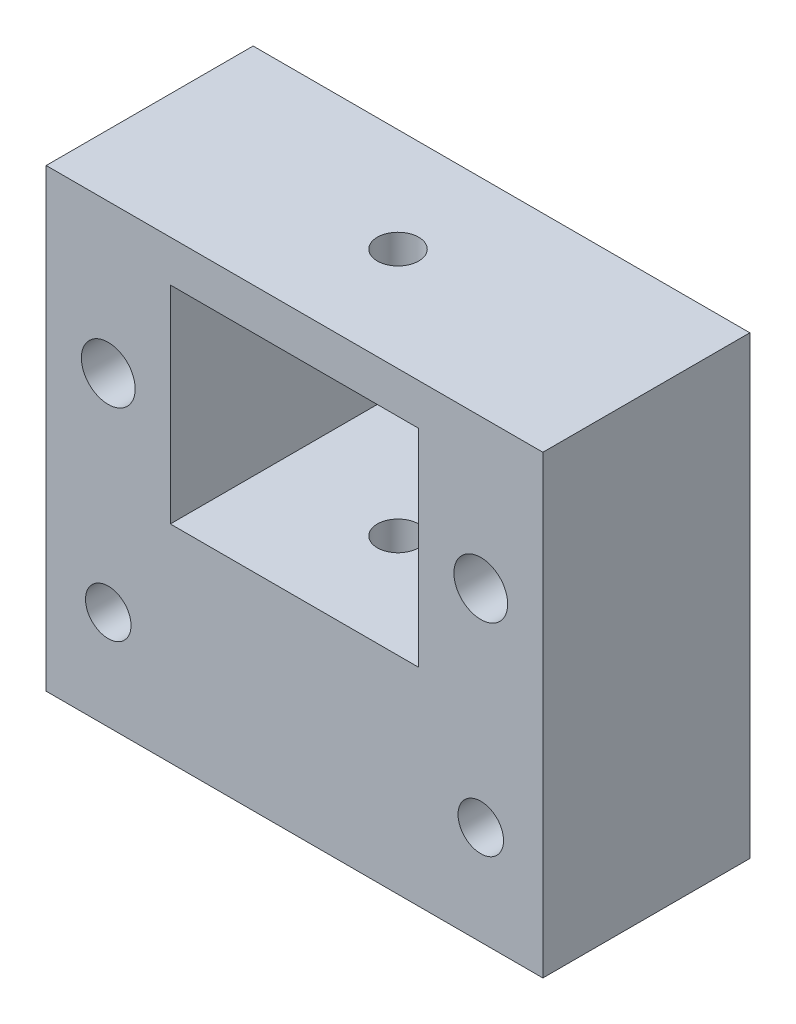
ISO-10303-21;
HEADER;
FILE_DESCRIPTION(('STEP AP214'),'2;1');
FILE_NAME('part.step','',(''),(''),'','','');
FILE_SCHEMA(('AUTOMOTIVE_DESIGN { 1 0 10303 214 1 1 1 1 }'));
ENDSEC;
DATA;
#1=APPLICATION_CONTEXT('core data for automotive mechanical design processes');
#2=APPLICATION_PROTOCOL_DEFINITION('international standard','automotive_design',2000,#1);
#3=PRODUCT_CONTEXT('',#1,'mechanical');
#4=PRODUCT('Part','Part','',(#3));
#5=PRODUCT_RELATED_PRODUCT_CATEGORY('part','',(#4));
#6=PRODUCT_DEFINITION_FORMATION('','',#4);
#7=PRODUCT_DEFINITION_CONTEXT('part definition',#1,'design');
#8=PRODUCT_DEFINITION('design','',#6,#7);
#9=PRODUCT_DEFINITION_SHAPE('','',#8);
#10=(LENGTH_UNIT() NAMED_UNIT(*) SI_UNIT(.MILLI.,.METRE.));
#11=(NAMED_UNIT(*) PLANE_ANGLE_UNIT() SI_UNIT($,.RADIAN.));
#12=(NAMED_UNIT(*) SI_UNIT($,.STERADIAN.) SOLID_ANGLE_UNIT());
#13=UNCERTAINTY_MEASURE_WITH_UNIT(LENGTH_MEASURE(1.E-05),#10,'distance_accuracy_value','');
#14=(GEOMETRIC_REPRESENTATION_CONTEXT(3) GLOBAL_UNCERTAINTY_ASSIGNED_CONTEXT((#13)) GLOBAL_UNIT_ASSIGNED_CONTEXT((#10,
#11,#12)) REPRESENTATION_CONTEXT('',''));
#15=CARTESIAN_POINT('',(0.,0.,0.));
#16=DIRECTION('',(0.,0.,1.));
#17=DIRECTION('',(1.,0.,0.));
#18=AXIS2_PLACEMENT_3D('',#15,#16,#17);
#19=CARTESIAN_POINT('',(7.5,37.,-25.));
#20=DIRECTION('',(0.,0.,1.));
#21=DIRECTION('',(1.,0.,0.));
#22=AXIS2_PLACEMENT_3D('',#19,#20,#21);
#23=CYLINDRICAL_SURFACE('',#22,3.25);
#24=CARTESIAN_POINT('',(7.5,37.,0.));
#25=DIRECTION('',(0.,0.,1.));
#26=DIRECTION('',(1.,0.,0.));
#27=AXIS2_PLACEMENT_3D('',#24,#25,#26);
#28=CIRCLE('',#27,3.25);
#29=CARTESIAN_POINT('',(10.75,37.,0.));
#30=VERTEX_POINT('',#29);
#31=EDGE_CURVE('E194',#30,#30,#28,.T.);
#32=ORIENTED_EDGE('',*,*,#31,.T.);
#33=EDGE_LOOP('',(#32));
#34=FACE_BOUND('',#33,.T.);
#35=CARTESIAN_POINT('',(7.5,37.,-13.5));
#36=DIRECTION('',(0.,0.,-1.));
#37=DIRECTION('',(-1.,0.,0.));
#38=AXIS2_PLACEMENT_3D('',#35,#36,#37);
#39=CIRCLE('',#38,3.25);
#40=CARTESIAN_POINT('',(4.25,37.,-13.5));
#41=VERTEX_POINT('',#40);
#42=EDGE_CURVE('E36',#41,#41,#39,.F.);
#43=ORIENTED_EDGE('',*,*,#42,.F.);
#44=EDGE_LOOP('',(#43));
#45=FACE_BOUND('',#44,.T.);
#46=ADVANCED_FACE('F32',(#34,#45),#23,.F.);
#47=CARTESIAN_POINT('',(52.5,37.,-25.));
#48=DIRECTION('',(0.,0.,1.));
#49=DIRECTION('',(1.,0.,0.));
#50=AXIS2_PLACEMENT_3D('',#47,#48,#49);
#51=CYLINDRICAL_SURFACE('',#50,3.25);
#52=CARTESIAN_POINT('',(52.5,37.,0.));
#53=DIRECTION('',(0.,0.,1.));
#54=DIRECTION('',(1.,0.,0.));
#55=AXIS2_PLACEMENT_3D('',#52,#53,#54);
#56=CIRCLE('',#55,3.25);
#57=CARTESIAN_POINT('',(55.75,37.,0.));
#58=VERTEX_POINT('',#57);
#59=EDGE_CURVE('E167',#58,#58,#56,.T.);
#60=ORIENTED_EDGE('',*,*,#59,.T.);
#61=EDGE_LOOP('',(#60));
#62=FACE_BOUND('',#61,.T.);
#63=CARTESIAN_POINT('',(52.5,37.,-13.5));
#64=DIRECTION('',(0.,0.,-1.));
#65=DIRECTION('',(-1.,0.,0.));
#66=AXIS2_PLACEMENT_3D('',#63,#64,#65);
#67=CIRCLE('',#66,3.25);
#68=CARTESIAN_POINT('',(49.25,37.,-13.5));
#69=VERTEX_POINT('',#68);
#70=EDGE_CURVE('E165',#69,#69,#67,.F.);
#71=ORIENTED_EDGE('',*,*,#70,.F.);
#72=EDGE_LOOP('',(#71));
#73=FACE_BOUND('',#72,.T.);
#74=ADVANCED_FACE('F225',(#62,#73),#51,.F.);
#75=CARTESIAN_POINT('',(0.,55.,0.));
#76=DIRECTION('',(0.,0.,-1.));
#77=DIRECTION('',(-1.,0.,0.));
#78=AXIS2_PLACEMENT_3D('',#75,#76,#77);
#79=PLANE('',#78);
#80=ORIENTED_EDGE('',*,*,#59,.F.);
#81=EDGE_LOOP('',(#80));
#82=FACE_BOUND('',#81,.T.);
#83=CARTESIAN_POINT('',(52.5,12.,0.));
#84=DIRECTION('',(0.,0.,1.));
#85=DIRECTION('',(1.,0.,0.));
#86=AXIS2_PLACEMENT_3D('',#83,#84,#85);
#87=CIRCLE('',#86,2.75);
#88=CARTESIAN_POINT('',(55.25,12.,0.));
#89=VERTEX_POINT('',#88);
#90=EDGE_CURVE('E172',#89,#89,#87,.T.);
#91=ORIENTED_EDGE('',*,*,#90,.F.);
#92=EDGE_LOOP('',(#91));
#93=FACE_BOUND('',#92,.T.);
#94=CARTESIAN_POINT('',(7.5,12.,0.));
#95=DIRECTION('',(0.,0.,1.));
#96=DIRECTION('',(1.,0.,0.));
#97=AXIS2_PLACEMENT_3D('',#94,#95,#96);
#98=CIRCLE('',#97,2.75);
#99=CARTESIAN_POINT('',(10.25,12.,0.));
#100=VERTEX_POINT('',#99);
#101=EDGE_CURVE('E188',#100,#100,#98,.T.);
#102=ORIENTED_EDGE('',*,*,#101,.F.);
#103=EDGE_LOOP('',(#102));
#104=FACE_BOUND('',#103,.T.);
#105=ORIENTED_EDGE('',*,*,#31,.F.);
#106=EDGE_LOOP('',(#105));
#107=FACE_BOUND('',#106,.T.);
#108=DIRECTION('',(0.,-1.,0.));
#109=VECTOR('',#108,1.);
#110=CARTESIAN_POINT('',(15.,50.,0.));
#111=LINE('',#110,#109);
#112=CARTESIAN_POINT('',(15.,50.,0.));
#113=VERTEX_POINT('',#112);
#114=CARTESIAN_POINT('',(15.,25.,0.));
#115=VERTEX_POINT('',#114);
#116=EDGE_CURVE('E121',#113,#115,#111,.T.);
#117=ORIENTED_EDGE('',*,*,#116,.F.);
#118=DIRECTION('',(-1.,0.,0.));
#119=VECTOR('',#118,1.);
#120=CARTESIAN_POINT('',(15.,50.,0.));
#121=LINE('',#120,#119);
#122=CARTESIAN_POINT('',(45.,50.,0.));
#123=VERTEX_POINT('',#122);
#124=EDGE_CURVE('E49',#123,#113,#121,.T.);
#125=ORIENTED_EDGE('',*,*,#124,.F.);
#126=DIRECTION('',(0.,1.,0.));
#127=VECTOR('',#126,1.);
#128=CARTESIAN_POINT('',(45.,50.,0.));
#129=LINE('',#128,#127);
#130=CARTESIAN_POINT('',(45.,25.,0.));
#131=VERTEX_POINT('',#130);
#132=EDGE_CURVE('E107',#131,#123,#129,.T.);
#133=ORIENTED_EDGE('',*,*,#132,.F.);
#134=DIRECTION('',(1.,0.,0.));
#135=VECTOR('',#134,1.);
#136=CARTESIAN_POINT('',(15.,25.,0.));
#137=LINE('',#136,#135);
#138=EDGE_CURVE('E127',#115,#131,#137,.T.);
#139=ORIENTED_EDGE('',*,*,#138,.F.);
#140=EDGE_LOOP('',(#117,#125,#133,#139));
#141=FACE_BOUND('',#140,.T.);
#142=DIRECTION('',(1.,0.,0.));
#143=VECTOR('',#142,1.);
#144=CARTESIAN_POINT('',(0.,0.,0.));
#145=LINE('',#144,#143);
#146=CARTESIAN_POINT('',(0.,0.,0.));
#147=VERTEX_POINT('',#146);
#148=CARTESIAN_POINT('',(60.,0.,0.));
#149=VERTEX_POINT('',#148);
#150=EDGE_CURVE('E113',#147,#149,#145,.T.);
#151=ORIENTED_EDGE('',*,*,#150,.T.);
#152=DIRECTION('',(0.,-1.,0.));
#153=VECTOR('',#152,1.);
#154=CARTESIAN_POINT('',(60.,55.,0.));
#155=LINE('',#154,#153);
#156=CARTESIAN_POINT('',(60.,55.,0.));
#157=VERTEX_POINT('',#156);
#158=EDGE_CURVE('E11',#157,#149,#155,.T.);
#159=ORIENTED_EDGE('',*,*,#158,.F.);
#160=DIRECTION('',(1.,0.,0.));
#161=VECTOR('',#160,1.);
#162=CARTESIAN_POINT('',(0.,55.,0.));
#163=LINE('',#162,#161);
#164=CARTESIAN_POINT('',(0.,55.,0.));
#165=VERTEX_POINT('',#164);
#166=EDGE_CURVE('E136',#165,#157,#163,.T.);
#167=ORIENTED_EDGE('',*,*,#166,.F.);
#168=DIRECTION('',(0.,-1.,0.));
#169=VECTOR('',#168,1.);
#170=CARTESIAN_POINT('',(0.,55.,0.));
#171=LINE('',#170,#169);
#172=EDGE_CURVE('E146',#165,#147,#171,.T.);
#173=ORIENTED_EDGE('',*,*,#172,.T.);
#174=EDGE_LOOP('',(#151,#159,#167,#173));
#175=FACE_BOUND('',#174,.T.);
#176=ADVANCED_FACE('F34',(#82,#93,#104,#107,#141,#175),#79,.F.);
#177=CARTESIAN_POINT('',(60.,55.,0.));
#178=DIRECTION('',(-1.,0.,0.));
#179=DIRECTION('',(0.,0.,1.));
#180=AXIS2_PLACEMENT_3D('',#177,#178,#179);
#181=PLANE('',#180);
#182=DIRECTION('',(0.,0.,-1.));
#183=VECTOR('',#182,1.);
#184=CARTESIAN_POINT('',(60.,0.,0.));
#185=LINE('',#184,#183);
#186=CARTESIAN_POINT('',(60.,0.,-25.));
#187=VERTEX_POINT('',#186);
#188=EDGE_CURVE('E149',#149,#187,#185,.T.);
#189=ORIENTED_EDGE('',*,*,#188,.T.);
#190=DIRECTION('',(0.,-1.,0.));
#191=VECTOR('',#190,1.);
#192=CARTESIAN_POINT('',(60.,55.,-25.));
#193=LINE('',#192,#191);
#194=CARTESIAN_POINT('',(60.,55.,-25.));
#195=VERTEX_POINT('',#194);
#196=EDGE_CURVE('E41',#195,#187,#193,.T.);
#197=ORIENTED_EDGE('',*,*,#196,.F.);
#198=DIRECTION('',(0.,0.,-1.));
#199=VECTOR('',#198,1.);
#200=CARTESIAN_POINT('',(60.,55.,0.));
#201=LINE('',#200,#199);
#202=EDGE_CURVE('E139',#157,#195,#201,.T.);
#203=ORIENTED_EDGE('',*,*,#202,.F.);
#204=ORIENTED_EDGE('',*,*,#158,.T.);
#205=EDGE_LOOP('',(#189,#197,#203,#204));
#206=FACE_BOUND('',#205,.T.);
#207=ADVANCED_FACE('F266',(#206),#181,.F.);
#208=CARTESIAN_POINT('',(0.,55.,-25.));
#209=DIRECTION('',(0.,0.,1.));
#210=DIRECTION('',(1.,0.,0.));
#211=AXIS2_PLACEMENT_3D('',#208,#209,#210);
#212=PLANE('',#211);
#213=CARTESIAN_POINT('',(7.5,37.,-25.));
#214=DIRECTION('',(0.,0.,-1.));
#215=DIRECTION('',(-1.,0.,0.));
#216=AXIS2_PLACEMENT_3D('',#213,#214,#215);
#217=CIRCLE('',#216,4.45);
#218=CARTESIAN_POINT('',(3.05,37.,-25.));
#219=VERTEX_POINT('',#218);
#220=EDGE_CURVE('E182',#219,#219,#217,.T.);
#221=ORIENTED_EDGE('',*,*,#220,.F.);
#222=EDGE_LOOP('',(#221));
#223=FACE_BOUND('',#222,.T.);
#224=CARTESIAN_POINT('',(52.5,37.,-25.));
#225=DIRECTION('',(0.,0.,-1.));
#226=DIRECTION('',(-1.,0.,0.));
#227=AXIS2_PLACEMENT_3D('',#224,#225,#226);
#228=CIRCLE('',#227,4.45);
#229=CARTESIAN_POINT('',(48.05,37.,-25.));
#230=VERTEX_POINT('',#229);
#231=EDGE_CURVE('E175',#230,#230,#228,.T.);
#232=ORIENTED_EDGE('',*,*,#231,.F.);
#233=EDGE_LOOP('',(#232));
#234=FACE_BOUND('',#233,.T.);
#235=CARTESIAN_POINT('',(52.5,12.,-25.));
#236=DIRECTION('',(0.,0.,1.));
#237=DIRECTION('',(1.,0.,0.));
#238=AXIS2_PLACEMENT_3D('',#235,#236,#237);
#239=CIRCLE('',#238,2.75);
#240=CARTESIAN_POINT('',(55.25,12.,-25.));
#241=VERTEX_POINT('',#240);
#242=EDGE_CURVE('E185',#241,#241,#239,.T.);
#243=ORIENTED_EDGE('',*,*,#242,.T.);
#244=EDGE_LOOP('',(#243));
#245=FACE_BOUND('',#244,.T.);
#246=CARTESIAN_POINT('',(7.5,12.,-25.));
#247=DIRECTION('',(0.,0.,1.));
#248=DIRECTION('',(1.,0.,0.));
#249=AXIS2_PLACEMENT_3D('',#246,#247,#248);
#250=CIRCLE('',#249,2.75);
#251=CARTESIAN_POINT('',(10.25,12.,-25.));
#252=VERTEX_POINT('',#251);
#253=EDGE_CURVE('E191',#252,#252,#250,.T.);
#254=ORIENTED_EDGE('',*,*,#253,.T.);
#255=EDGE_LOOP('',(#254));
#256=FACE_BOUND('',#255,.T.);
#257=DIRECTION('',(0.,-1.,0.));
#258=VECTOR('',#257,1.);
#259=CARTESIAN_POINT('',(45.,50.,-25.));
#260=LINE('',#259,#258);
#261=CARTESIAN_POINT('',(45.,50.,-25.));
#262=VERTEX_POINT('',#261);
#263=CARTESIAN_POINT('',(45.,25.,-25.));
#264=VERTEX_POINT('',#263);
#265=EDGE_CURVE('E119',#262,#264,#260,.T.);
#266=ORIENTED_EDGE('',*,*,#265,.F.);
#267=DIRECTION('',(1.,0.,0.));
#268=VECTOR('',#267,1.);
#269=CARTESIAN_POINT('',(15.,50.,-25.));
#270=LINE('',#269,#268);
#271=CARTESIAN_POINT('',(15.,50.,-25.));
#272=VERTEX_POINT('',#271);
#273=EDGE_CURVE('E101',#272,#262,#270,.T.);
#274=ORIENTED_EDGE('',*,*,#273,.F.);
#275=DIRECTION('',(0.,1.,0.));
#276=VECTOR('',#275,1.);
#277=CARTESIAN_POINT('',(15.,50.,-25.));
#278=LINE('',#277,#276);
#279=CARTESIAN_POINT('',(15.,25.,-25.));
#280=VERTEX_POINT('',#279);
#281=EDGE_CURVE('E110',#280,#272,#278,.T.);
#282=ORIENTED_EDGE('',*,*,#281,.F.);
#283=DIRECTION('',(-1.,0.,0.));
#284=VECTOR('',#283,1.);
#285=CARTESIAN_POINT('',(15.,25.,-25.));
#286=LINE('',#285,#284);
#287=EDGE_CURVE('E57',#264,#280,#286,.T.);
#288=ORIENTED_EDGE('',*,*,#287,.F.);
#289=EDGE_LOOP('',(#266,#274,#282,#288));
#290=FACE_BOUND('',#289,.T.);
#291=DIRECTION('',(-1.,0.,0.));
#292=VECTOR('',#291,1.);
#293=CARTESIAN_POINT('',(0.,0.,-25.));
#294=LINE('',#293,#292);
#295=CARTESIAN_POINT('',(0.,0.,-25.));
#296=VERTEX_POINT('',#295);
#297=EDGE_CURVE('E151',#187,#296,#294,.T.);
#298=ORIENTED_EDGE('',*,*,#297,.T.);
#299=DIRECTION('',(0.,-1.,0.));
#300=VECTOR('',#299,1.);
#301=CARTESIAN_POINT('',(0.,55.,-25.));
#302=LINE('',#301,#300);
#303=CARTESIAN_POINT('',(0.,55.,-25.));
#304=VERTEX_POINT('',#303);
#305=EDGE_CURVE('E156',#304,#296,#302,.T.);
#306=ORIENTED_EDGE('',*,*,#305,.F.);
#307=DIRECTION('',(-1.,0.,0.));
#308=VECTOR('',#307,1.);
#309=CARTESIAN_POINT('',(0.,55.,-25.));
#310=LINE('',#309,#308);
#311=EDGE_CURVE('E142',#195,#304,#310,.T.);
#312=ORIENTED_EDGE('',*,*,#311,.F.);
#313=ORIENTED_EDGE('',*,*,#196,.T.);
#314=EDGE_LOOP('',(#298,#306,#312,#313));
#315=FACE_BOUND('',#314,.T.);
#316=ADVANCED_FACE('F116',(#223,#234,#245,#256,#290,#315),#212,.F.);
#317=CARTESIAN_POINT('',(0.,55.,0.));
#318=DIRECTION('',(1.,0.,0.));
#319=DIRECTION('',(0.,0.,-1.));
#320=AXIS2_PLACEMENT_3D('',#317,#318,#319);
#321=PLANE('',#320);
#322=DIRECTION('',(0.,0.,1.));
#323=VECTOR('',#322,1.);
#324=CARTESIAN_POINT('',(0.,0.,0.));
#325=LINE('',#324,#323);
#326=EDGE_CURVE('E140',#296,#147,#325,.T.);
#327=ORIENTED_EDGE('',*,*,#326,.T.);
#328=ORIENTED_EDGE('',*,*,#172,.F.);
#329=DIRECTION('',(0.,0.,1.));
#330=VECTOR('',#329,1.);
#331=CARTESIAN_POINT('',(0.,55.,0.));
#332=LINE('',#331,#330);
#333=EDGE_CURVE('E144',#304,#165,#332,.T.);
#334=ORIENTED_EDGE('',*,*,#333,.F.);
#335=ORIENTED_EDGE('',*,*,#305,.T.);
#336=EDGE_LOOP('',(#327,#328,#334,#335));
#337=FACE_BOUND('',#336,.T.);
#338=ADVANCED_FACE('F265',(#337),#321,.F.);
#339=CARTESIAN_POINT('',(0.,55.,0.));
#340=DIRECTION('',(0.,1.,0.));
#341=DIRECTION('',(0.,0.,1.));
#342=AXIS2_PLACEMENT_3D('',#339,#340,#341);
#343=PLANE('',#342);
#344=CARTESIAN_POINT('',(30.,55.,-12.5));
#345=DIRECTION('',(0.,1.,0.));
#346=DIRECTION('',(0.,0.,1.));
#347=AXIS2_PLACEMENT_3D('',#344,#345,#346);
#348=CIRCLE('',#347,2.5);
#349=CARTESIAN_POINT('',(30.,55.,-10.));
#350=VERTEX_POINT('',#349);
#351=EDGE_CURVE('E199',#350,#350,#348,.T.);
#352=ORIENTED_EDGE('',*,*,#351,.F.);
#353=EDGE_LOOP('',(#352));
#354=FACE_BOUND('',#353,.T.);
#355=ORIENTED_EDGE('',*,*,#166,.T.);
#356=ORIENTED_EDGE('',*,*,#202,.T.);
#357=ORIENTED_EDGE('',*,*,#311,.T.);
#358=ORIENTED_EDGE('',*,*,#333,.T.);
#359=EDGE_LOOP('',(#355,#356,#357,#358));
#360=FACE_BOUND('',#359,.T.);
#361=ADVANCED_FACE('F295',(#354,#360),#343,.T.);
#362=CARTESIAN_POINT('',(0.,0.,0.));
#363=DIRECTION('',(0.,1.,0.));
#364=DIRECTION('',(0.,0.,1.));
#365=AXIS2_PLACEMENT_3D('',#362,#363,#364);
#366=PLANE('',#365);
#367=CARTESIAN_POINT('',(30.,0.,-12.5));
#368=DIRECTION('',(0.,1.,0.));
#369=DIRECTION('',(0.,0.,1.));
#370=AXIS2_PLACEMENT_3D('',#367,#368,#369);
#371=CIRCLE('',#370,2.5);
#372=CARTESIAN_POINT('',(30.,0.,-10.));
#373=VERTEX_POINT('',#372);
#374=EDGE_CURVE('E164',#373,#373,#371,.T.);
#375=ORIENTED_EDGE('',*,*,#374,.T.);
#376=EDGE_LOOP('',(#375));
#377=FACE_BOUND('',#376,.T.);
#378=ORIENTED_EDGE('',*,*,#150,.F.);
#379=ORIENTED_EDGE('',*,*,#326,.F.);
#380=ORIENTED_EDGE('',*,*,#297,.F.);
#381=ORIENTED_EDGE('',*,*,#188,.F.);
#382=EDGE_LOOP('',(#378,#379,#380,#381));
#383=FACE_BOUND('',#382,.T.);
#384=ADVANCED_FACE('F289',(#377,#383),#366,.F.);
#385=CARTESIAN_POINT('',(15.,50.,-25.001));
#386=DIRECTION('',(0.,1.,0.));
#387=DIRECTION('',(-1.,0.,0.));
#388=AXIS2_PLACEMENT_3D('',#385,#386,#387);
#389=PLANE('',#388);
#390=CARTESIAN_POINT('',(30.,50.,-12.5));
#391=DIRECTION('',(0.,1.,0.));
#392=DIRECTION('',(-1.,0.,0.));
#393=AXIS2_PLACEMENT_3D('',#390,#391,#392);
#394=CIRCLE('',#393,2.5);
#395=CARTESIAN_POINT('',(27.5,50.,-12.5));
#396=VERTEX_POINT('',#395);
#397=EDGE_CURVE('E163',#396,#396,#394,.T.);
#398=ORIENTED_EDGE('',*,*,#397,.T.);
#399=EDGE_LOOP('',(#398));
#400=FACE_BOUND('',#399,.T.);
#401=ORIENTED_EDGE('',*,*,#273,.T.);
#402=DIRECTION('',(0.,0.,1.));
#403=VECTOR('',#402,1.);
#404=CARTESIAN_POINT('',(45.,50.,-25.001));
#405=LINE('',#404,#403);
#406=EDGE_CURVE('E114',#262,#123,#405,.T.);
#407=ORIENTED_EDGE('',*,*,#406,.T.);
#408=ORIENTED_EDGE('',*,*,#124,.T.);
#409=DIRECTION('',(0.,0.,1.));
#410=VECTOR('',#409,1.);
#411=CARTESIAN_POINT('',(15.,50.,-25.001));
#412=LINE('',#411,#410);
#413=EDGE_CURVE('E97',#272,#113,#412,.T.);
#414=ORIENTED_EDGE('',*,*,#413,.F.);
#415=EDGE_LOOP('',(#401,#407,#408,#414));
#416=FACE_BOUND('',#415,.T.);
#417=ADVANCED_FACE('F99',(#400,#416),#389,.F.);
#418=CARTESIAN_POINT('',(45.,50.,-25.001));
#419=DIRECTION('',(1.,0.,0.));
#420=DIRECTION('',(0.,0.,-1.));
#421=AXIS2_PLACEMENT_3D('',#418,#419,#420);
#422=PLANE('',#421);
#423=ORIENTED_EDGE('',*,*,#265,.T.);
#424=DIRECTION('',(0.,0.,1.));
#425=VECTOR('',#424,1.);
#426=CARTESIAN_POINT('',(45.,25.,-25.001));
#427=LINE('',#426,#425);
#428=EDGE_CURVE('E133',#264,#131,#427,.T.);
#429=ORIENTED_EDGE('',*,*,#428,.T.);
#430=ORIENTED_EDGE('',*,*,#132,.T.);
#431=ORIENTED_EDGE('',*,*,#406,.F.);
#432=EDGE_LOOP('',(#423,#429,#430,#431));
#433=FACE_BOUND('',#432,.T.);
#434=ADVANCED_FACE('F379',(#433),#422,.F.);
#435=CARTESIAN_POINT('',(15.,25.,-25.001));
#436=DIRECTION('',(0.,-1.,0.));
#437=DIRECTION('',(1.,0.,0.));
#438=AXIS2_PLACEMENT_3D('',#435,#436,#437);
#439=PLANE('',#438);
#440=CARTESIAN_POINT('',(30.,25.,-12.5));
#441=DIRECTION('',(0.,-1.,0.));
#442=DIRECTION('',(1.,0.,0.));
#443=AXIS2_PLACEMENT_3D('',#440,#441,#442);
#444=CIRCLE('',#443,2.5);
#445=CARTESIAN_POINT('',(32.5,25.,-12.5));
#446=VERTEX_POINT('',#445);
#447=EDGE_CURVE('E161',#446,#446,#444,.T.);
#448=ORIENTED_EDGE('',*,*,#447,.T.);
#449=EDGE_LOOP('',(#448));
#450=FACE_BOUND('',#449,.T.);
#451=ORIENTED_EDGE('',*,*,#287,.T.);
#452=DIRECTION('',(0.,0.,1.));
#453=VECTOR('',#452,1.);
#454=CARTESIAN_POINT('',(15.,25.,-25.001));
#455=LINE('',#454,#453);
#456=EDGE_CURVE('E106',#280,#115,#455,.T.);
#457=ORIENTED_EDGE('',*,*,#456,.T.);
#458=ORIENTED_EDGE('',*,*,#138,.T.);
#459=ORIENTED_EDGE('',*,*,#428,.F.);
#460=EDGE_LOOP('',(#451,#457,#458,#459));
#461=FACE_BOUND('',#460,.T.);
#462=ADVANCED_FACE('F374',(#450,#461),#439,.F.);
#463=CARTESIAN_POINT('',(15.,50.,-25.001));
#464=DIRECTION('',(-1.,0.,0.));
#465=DIRECTION('',(0.,-1.,0.));
#466=AXIS2_PLACEMENT_3D('',#463,#464,#465);
#467=PLANE('',#466);
#468=ORIENTED_EDGE('',*,*,#281,.T.);
#469=ORIENTED_EDGE('',*,*,#413,.T.);
#470=ORIENTED_EDGE('',*,*,#116,.T.);
#471=ORIENTED_EDGE('',*,*,#456,.F.);
#472=EDGE_LOOP('',(#468,#469,#470,#471));
#473=FACE_BOUND('',#472,.T.);
#474=ADVANCED_FACE('F111',(#473),#467,.F.);
#475=CARTESIAN_POINT('',(30.,0.,-12.5));
#476=DIRECTION('',(0.,1.,0.));
#477=DIRECTION('',(0.,0.,1.));
#478=AXIS2_PLACEMENT_3D('',#475,#476,#477);
#479=CYLINDRICAL_SURFACE('',#478,2.5);
#480=ORIENTED_EDGE('',*,*,#374,.F.);
#481=EDGE_LOOP('',(#480));
#482=FACE_BOUND('',#481,.T.);
#483=ORIENTED_EDGE('',*,*,#447,.F.);
#484=EDGE_LOOP('',(#483));
#485=FACE_BOUND('',#484,.T.);
#486=ADVANCED_FACE('F211',(#482,#485),#479,.F.);
#487=ORIENTED_EDGE('',*,*,#351,.T.);
#488=EDGE_LOOP('',(#487));
#489=FACE_BOUND('',#488,.T.);
#490=ORIENTED_EDGE('',*,*,#397,.F.);
#491=EDGE_LOOP('',(#490));
#492=FACE_BOUND('',#491,.T.);
#493=ADVANCED_FACE('F208',(#489,#492),#479,.F.);
#494=CARTESIAN_POINT('',(7.5,12.,-25.));
#495=DIRECTION('',(0.,0.,1.));
#496=DIRECTION('',(1.,0.,0.));
#497=AXIS2_PLACEMENT_3D('',#494,#495,#496);
#498=CYLINDRICAL_SURFACE('',#497,2.75);
#499=ORIENTED_EDGE('',*,*,#253,.F.);
#500=EDGE_LOOP('',(#499));
#501=FACE_BOUND('',#500,.T.);
#502=ORIENTED_EDGE('',*,*,#101,.T.);
#503=EDGE_LOOP('',(#502));
#504=FACE_BOUND('',#503,.T.);
#505=ADVANCED_FACE('F210',(#501,#504),#498,.F.);
#506=CARTESIAN_POINT('',(52.5,12.,-25.));
#507=DIRECTION('',(0.,0.,1.));
#508=DIRECTION('',(1.,0.,0.));
#509=AXIS2_PLACEMENT_3D('',#506,#507,#508);
#510=CYLINDRICAL_SURFACE('',#509,2.75);
#511=ORIENTED_EDGE('',*,*,#242,.F.);
#512=EDGE_LOOP('',(#511));
#513=FACE_BOUND('',#512,.T.);
#514=ORIENTED_EDGE('',*,*,#90,.T.);
#515=EDGE_LOOP('',(#514));
#516=FACE_BOUND('',#515,.T.);
#517=ADVANCED_FACE('F218',(#513,#516),#510,.F.);
#518=CARTESIAN_POINT('',(52.5,37.,-13.5));
#519=DIRECTION('',(0.,0.,-1.));
#520=DIRECTION('',(-1.,0.,0.));
#521=AXIS2_PLACEMENT_3D('',#518,#519,#520);
#522=PLANE('',#521);
#523=CARTESIAN_POINT('',(52.5,37.,-13.5));
#524=DIRECTION('',(0.,0.,-1.));
#525=DIRECTION('',(-1.,0.,0.));
#526=AXIS2_PLACEMENT_3D('',#523,#524,#525);
#527=CIRCLE('',#526,4.45);
#528=CARTESIAN_POINT('',(48.05,37.,-13.5));
#529=VERTEX_POINT('',#528);
#530=EDGE_CURVE('E168',#529,#529,#527,.T.);
#531=ORIENTED_EDGE('',*,*,#530,.T.);
#532=EDGE_LOOP('',(#531));
#533=FACE_BOUND('',#532,.T.);
#534=ORIENTED_EDGE('',*,*,#70,.T.);
#535=EDGE_LOOP('',(#534));
#536=FACE_BOUND('',#535,.T.);
#537=ADVANCED_FACE('F235',(#533,#536),#522,.T.);
#538=CARTESIAN_POINT('',(52.5,37.,-13.5));
#539=DIRECTION('',(0.,0.,-1.));
#540=DIRECTION('',(-1.,0.,0.));
#541=AXIS2_PLACEMENT_3D('',#538,#539,#540);
#542=CYLINDRICAL_SURFACE('',#541,4.45);
#543=ORIENTED_EDGE('',*,*,#530,.F.);
#544=EDGE_LOOP('',(#543));
#545=FACE_BOUND('',#544,.T.);
#546=ORIENTED_EDGE('',*,*,#231,.T.);
#547=EDGE_LOOP('',(#546));
#548=FACE_BOUND('',#547,.T.);
#549=ADVANCED_FACE('F238',(#545,#548),#542,.F.);
#550=CARTESIAN_POINT('',(7.5,37.,-13.5));
#551=DIRECTION('',(0.,0.,-1.));
#552=DIRECTION('',(-1.,0.,0.));
#553=AXIS2_PLACEMENT_3D('',#550,#551,#552);
#554=PLANE('',#553);
#555=CARTESIAN_POINT('',(7.5,37.,-13.5));
#556=DIRECTION('',(0.,0.,-1.));
#557=DIRECTION('',(-1.,0.,0.));
#558=AXIS2_PLACEMENT_3D('',#555,#556,#557);
#559=CIRCLE('',#558,4.45);
#560=CARTESIAN_POINT('',(3.05,37.,-13.5));
#561=VERTEX_POINT('',#560);
#562=EDGE_CURVE('E256',#561,#561,#559,.T.);
#563=ORIENTED_EDGE('',*,*,#562,.T.);
#564=EDGE_LOOP('',(#563));
#565=FACE_BOUND('',#564,.T.);
#566=ORIENTED_EDGE('',*,*,#42,.T.);
#567=EDGE_LOOP('',(#566));
#568=FACE_BOUND('',#567,.T.);
#569=ADVANCED_FACE('F241',(#565,#568),#554,.T.);
#570=CARTESIAN_POINT('',(7.5,37.,-13.5));
#571=DIRECTION('',(0.,0.,-1.));
#572=DIRECTION('',(-1.,0.,0.));
#573=AXIS2_PLACEMENT_3D('',#570,#571,#572);
#574=CYLINDRICAL_SURFACE('',#573,4.45);
#575=ORIENTED_EDGE('',*,*,#562,.F.);
#576=EDGE_LOOP('',(#575));
#577=FACE_BOUND('',#576,.T.);
#578=ORIENTED_EDGE('',*,*,#220,.T.);
#579=EDGE_LOOP('',(#578));
#580=FACE_BOUND('',#579,.T.);
#581=ADVANCED_FACE('F245',(#577,#580),#574,.F.);
#582=CLOSED_SHELL('',(#46,#74,#176,#207,#316,#338,#361,#384,#417,#434,#462,#474,#486,#493,#505,
#517,#537,#549,#569,#581));
#583=MANIFOLD_SOLID_BREP('B2',#582);
#584=ADVANCED_BREP_SHAPE_REPRESENTATION('',(#18,#583),#14);
#585=SHAPE_DEFINITION_REPRESENTATION(#9,#584);
ENDSEC;
END-ISO-10303-21;
